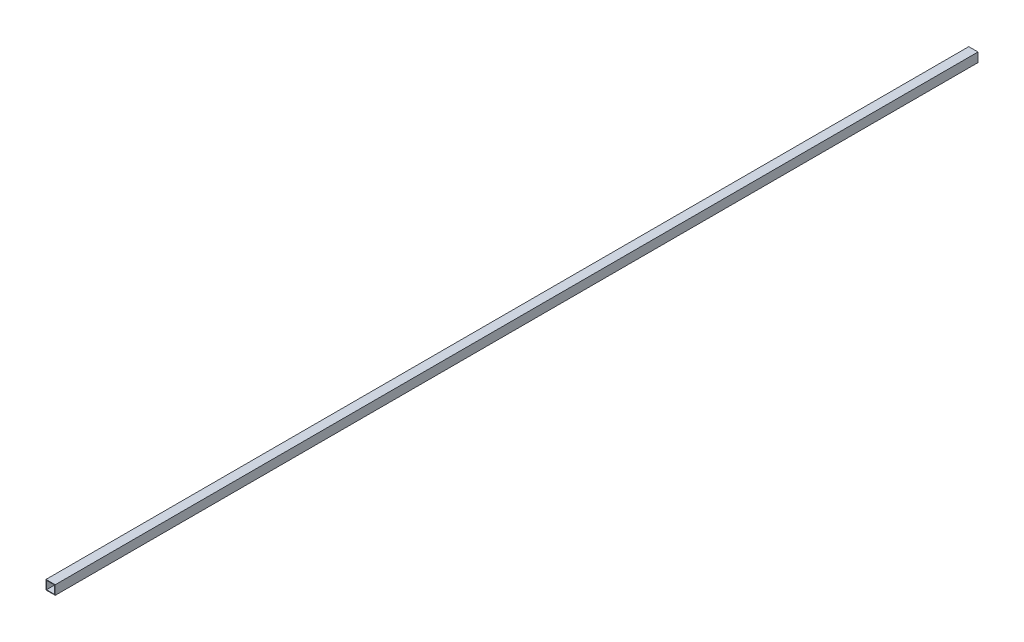
ISO-10303-21;
HEADER;
FILE_DESCRIPTION(('STEP AP214'),'2;1');
FILE_NAME('part.step','',(''),(''),'','','');
FILE_SCHEMA(('AUTOMOTIVE_DESIGN { 1 0 10303 214 1 1 1 1 }'));
ENDSEC;
DATA;
#1=APPLICATION_CONTEXT('core data for automotive mechanical design processes');
#2=APPLICATION_PROTOCOL_DEFINITION('international standard','automotive_design',2000,#1);
#3=PRODUCT_CONTEXT('',#1,'mechanical');
#4=PRODUCT('Part','Part','',(#3));
#5=PRODUCT_RELATED_PRODUCT_CATEGORY('part','',(#4));
#6=PRODUCT_DEFINITION_FORMATION('','',#4);
#7=PRODUCT_DEFINITION_CONTEXT('part definition',#1,'design');
#8=PRODUCT_DEFINITION('design','',#6,#7);
#9=PRODUCT_DEFINITION_SHAPE('','',#8);
#10=(LENGTH_UNIT() NAMED_UNIT(*) SI_UNIT(.MILLI.,.METRE.));
#11=(NAMED_UNIT(*) PLANE_ANGLE_UNIT() SI_UNIT($,.RADIAN.));
#12=(NAMED_UNIT(*) SI_UNIT($,.STERADIAN.) SOLID_ANGLE_UNIT());
#13=UNCERTAINTY_MEASURE_WITH_UNIT(LENGTH_MEASURE(1.E-05),#10,'distance_accuracy_value','');
#14=(GEOMETRIC_REPRESENTATION_CONTEXT(3) GLOBAL_UNCERTAINTY_ASSIGNED_CONTEXT((#13)) GLOBAL_UNIT_ASSIGNED_CONTEXT((#10,
#11,#12)) REPRESENTATION_CONTEXT('',''));
#15=CARTESIAN_POINT('',(0.,0.,0.));
#16=DIRECTION('',(0.,0.,1.));
#17=DIRECTION('',(1.,0.,0.));
#18=AXIS2_PLACEMENT_3D('',#15,#16,#17);
#19=CARTESIAN_POINT('',(0.,0.,1270.));
#20=DIRECTION('',(0.,0.,-1.));
#21=DIRECTION('',(-1.,0.,0.));
#22=AXIS2_PLACEMENT_3D('',#19,#20,#21);
#23=PLANE('',#22);
#24=DIRECTION('',(0.,1.,0.));
#25=VECTOR('',#24,1.);
#26=CARTESIAN_POINT('',(12.7,-12.7,1270.));
#27=LINE('',#26,#25);
#28=CARTESIAN_POINT('',(12.7,-12.7,1270.));
#29=VERTEX_POINT('',#28);
#30=CARTESIAN_POINT('',(12.7,12.7,1270.));
#31=VERTEX_POINT('',#30);
#32=EDGE_CURVE('E136',#29,#31,#27,.T.);
#33=ORIENTED_EDGE('',*,*,#32,.T.);
#34=DIRECTION('',(-1.,0.,0.));
#35=VECTOR('',#34,1.);
#36=CARTESIAN_POINT('',(-12.7,12.7,1270.));
#37=LINE('',#36,#35);
#38=CARTESIAN_POINT('',(-12.7,12.7,1270.));
#39=VERTEX_POINT('',#38);
#40=EDGE_CURVE('E139',#31,#39,#37,.T.);
#41=ORIENTED_EDGE('',*,*,#40,.T.);
#42=DIRECTION('',(0.,-1.,0.));
#43=VECTOR('',#42,1.);
#44=CARTESIAN_POINT('',(-12.7,-12.7,1270.));
#45=LINE('',#44,#43);
#46=CARTESIAN_POINT('',(-12.7,-12.7,1270.));
#47=VERTEX_POINT('',#46);
#48=EDGE_CURVE('E142',#39,#47,#45,.T.);
#49=ORIENTED_EDGE('',*,*,#48,.T.);
#50=DIRECTION('',(1.,0.,0.));
#51=VECTOR('',#50,1.);
#52=CARTESIAN_POINT('',(-12.7,-12.7,1270.));
#53=LINE('',#52,#51);
#54=EDGE_CURVE('E144',#47,#29,#53,.T.);
#55=ORIENTED_EDGE('',*,*,#54,.T.);
#56=EDGE_LOOP('',(#33,#41,#49,#55));
#57=FACE_BOUND('',#56,.T.);
#58=DIRECTION('',(0.,-1.,0.));
#59=VECTOR('',#58,1.);
#60=CARTESIAN_POINT('',(-11.1125,-11.1125,1270.));
#61=LINE('',#60,#59);
#62=CARTESIAN_POINT('',(-11.1125,11.1125,1270.));
#63=VERTEX_POINT('',#62);
#64=CARTESIAN_POINT('',(-11.1125,-11.1125,1270.));
#65=VERTEX_POINT('',#64);
#66=EDGE_CURVE('E100',#63,#65,#61,.T.);
#67=ORIENTED_EDGE('',*,*,#66,.F.);
#68=DIRECTION('',(-1.,0.,0.));
#69=VECTOR('',#68,1.);
#70=CARTESIAN_POINT('',(11.1125,11.1125,1270.));
#71=LINE('',#70,#69);
#72=CARTESIAN_POINT('',(11.1125,11.1125,1270.));
#73=VERTEX_POINT('',#72);
#74=EDGE_CURVE('E122',#73,#63,#71,.T.);
#75=ORIENTED_EDGE('',*,*,#74,.F.);
#76=DIRECTION('',(0.,1.,0.));
#77=VECTOR('',#76,1.);
#78=CARTESIAN_POINT('',(11.1125,-11.1125,1270.));
#79=LINE('',#78,#77);
#80=CARTESIAN_POINT('',(11.1125,-11.1125,1270.));
#81=VERTEX_POINT('',#80);
#82=EDGE_CURVE('E120',#81,#73,#79,.T.);
#83=ORIENTED_EDGE('',*,*,#82,.F.);
#84=DIRECTION('',(1.,0.,0.));
#85=VECTOR('',#84,1.);
#86=CARTESIAN_POINT('',(11.1125,-11.1125,1270.));
#87=LINE('',#86,#85);
#88=EDGE_CURVE('E108',#65,#81,#87,.T.);
#89=ORIENTED_EDGE('',*,*,#88,.F.);
#90=EDGE_LOOP('',(#67,#75,#83,#89));
#91=FACE_BOUND('',#90,.T.);
#92=ADVANCED_FACE('F35',(#57,#91),#23,.F.);
#93=CARTESIAN_POINT('',(0.,0.,-1270.));
#94=DIRECTION('',(0.,0.,-1.));
#95=DIRECTION('',(-1.,0.,0.));
#96=AXIS2_PLACEMENT_3D('',#93,#94,#95);
#97=PLANE('',#96);
#98=DIRECTION('',(0.,1.,0.));
#99=VECTOR('',#98,1.);
#100=CARTESIAN_POINT('',(12.7,-12.7,-1270.));
#101=LINE('',#100,#99);
#102=CARTESIAN_POINT('',(12.7,-12.7,-1270.));
#103=VERTEX_POINT('',#102);
#104=CARTESIAN_POINT('',(12.7,12.7,-1270.));
#105=VERTEX_POINT('',#104);
#106=EDGE_CURVE('E116',#103,#105,#101,.T.);
#107=ORIENTED_EDGE('',*,*,#106,.F.);
#108=DIRECTION('',(1.,0.,0.));
#109=VECTOR('',#108,1.);
#110=CARTESIAN_POINT('',(-12.7,-12.7,-1270.));
#111=LINE('',#110,#109);
#112=CARTESIAN_POINT('',(-12.7,-12.7,-1270.));
#113=VERTEX_POINT('',#112);
#114=EDGE_CURVE('E140',#113,#103,#111,.T.);
#115=ORIENTED_EDGE('',*,*,#114,.F.);
#116=DIRECTION('',(0.,-1.,0.));
#117=VECTOR('',#116,1.);
#118=CARTESIAN_POINT('',(-12.7,-12.7,-1270.));
#119=LINE('',#118,#117);
#120=CARTESIAN_POINT('',(-12.7,12.7,-1270.));
#121=VERTEX_POINT('',#120);
#122=EDGE_CURVE('E151',#121,#113,#119,.T.);
#123=ORIENTED_EDGE('',*,*,#122,.F.);
#124=DIRECTION('',(-1.,0.,0.));
#125=VECTOR('',#124,1.);
#126=CARTESIAN_POINT('',(-12.7,12.7,-1270.));
#127=LINE('',#126,#125);
#128=EDGE_CURVE('E149',#105,#121,#127,.T.);
#129=ORIENTED_EDGE('',*,*,#128,.F.);
#130=EDGE_LOOP('',(#107,#115,#123,#129));
#131=FACE_BOUND('',#130,.T.);
#132=DIRECTION('',(-1.,0.,0.));
#133=VECTOR('',#132,1.);
#134=CARTESIAN_POINT('',(11.1125,11.1125,-1270.));
#135=LINE('',#134,#133);
#136=CARTESIAN_POINT('',(11.1125,11.1125,-1270.));
#137=VERTEX_POINT('',#136);
#138=CARTESIAN_POINT('',(-11.1125,11.1125,-1270.));
#139=VERTEX_POINT('',#138);
#140=EDGE_CURVE('E109',#137,#139,#135,.T.);
#141=ORIENTED_EDGE('',*,*,#140,.T.);
#142=DIRECTION('',(0.,-1.,0.));
#143=VECTOR('',#142,1.);
#144=CARTESIAN_POINT('',(-11.1125,-11.1125,-1270.));
#145=LINE('',#144,#143);
#146=CARTESIAN_POINT('',(-11.1125,-11.1125,-1270.));
#147=VERTEX_POINT('',#146);
#148=EDGE_CURVE('E58',#139,#147,#145,.T.);
#149=ORIENTED_EDGE('',*,*,#148,.T.);
#150=DIRECTION('',(1.,0.,0.));
#151=VECTOR('',#150,1.);
#152=CARTESIAN_POINT('',(11.1125,-11.1125,-1270.));
#153=LINE('',#152,#151);
#154=CARTESIAN_POINT('',(11.1125,-11.1125,-1270.));
#155=VERTEX_POINT('',#154);
#156=EDGE_CURVE('E115',#147,#155,#153,.T.);
#157=ORIENTED_EDGE('',*,*,#156,.T.);
#158=DIRECTION('',(0.,1.,0.));
#159=VECTOR('',#158,1.);
#160=CARTESIAN_POINT('',(11.1125,-11.1125,-1270.));
#161=LINE('',#160,#159);
#162=EDGE_CURVE('E128',#155,#137,#161,.T.);
#163=ORIENTED_EDGE('',*,*,#162,.T.);
#164=EDGE_LOOP('',(#141,#149,#157,#163));
#165=FACE_BOUND('',#164,.T.);
#166=ADVANCED_FACE('F169',(#131,#165),#97,.T.);
#167=CARTESIAN_POINT('',(12.7,-12.7,1270.));
#168=DIRECTION('',(-1.,0.,0.));
#169=DIRECTION('',(0.,0.,1.));
#170=AXIS2_PLACEMENT_3D('',#167,#168,#169);
#171=PLANE('',#170);
#172=ORIENTED_EDGE('',*,*,#106,.T.);
#173=DIRECTION('',(0.,0.,-1.));
#174=VECTOR('',#173,1.);
#175=CARTESIAN_POINT('',(12.7,12.7,1270.));
#176=LINE('',#175,#174);
#177=EDGE_CURVE('E11',#31,#105,#176,.T.);
#178=ORIENTED_EDGE('',*,*,#177,.F.);
#179=ORIENTED_EDGE('',*,*,#32,.F.);
#180=DIRECTION('',(0.,0.,-1.));
#181=VECTOR('',#180,1.);
#182=CARTESIAN_POINT('',(12.7,-12.7,1270.));
#183=LINE('',#182,#181);
#184=EDGE_CURVE('E146',#29,#103,#183,.T.);
#185=ORIENTED_EDGE('',*,*,#184,.T.);
#186=EDGE_LOOP('',(#172,#178,#179,#185));
#187=FACE_BOUND('',#186,.T.);
#188=ADVANCED_FACE('F37',(#187),#171,.F.);
#189=CARTESIAN_POINT('',(-12.7,12.7,1270.));
#190=DIRECTION('',(0.,-1.,0.));
#191=DIRECTION('',(0.,0.,-1.));
#192=AXIS2_PLACEMENT_3D('',#189,#190,#191);
#193=PLANE('',#192);
#194=ORIENTED_EDGE('',*,*,#128,.T.);
#195=DIRECTION('',(0.,0.,-1.));
#196=VECTOR('',#195,1.);
#197=CARTESIAN_POINT('',(-12.7,12.7,1270.));
#198=LINE('',#197,#196);
#199=EDGE_CURVE('E43',#39,#121,#198,.T.);
#200=ORIENTED_EDGE('',*,*,#199,.F.);
#201=ORIENTED_EDGE('',*,*,#40,.F.);
#202=ORIENTED_EDGE('',*,*,#177,.T.);
#203=EDGE_LOOP('',(#194,#200,#201,#202));
#204=FACE_BOUND('',#203,.T.);
#205=ADVANCED_FACE('F179',(#204),#193,.F.);
#206=CARTESIAN_POINT('',(-12.7,-12.7,1270.));
#207=DIRECTION('',(1.,0.,0.));
#208=DIRECTION('',(0.,0.,-1.));
#209=AXIS2_PLACEMENT_3D('',#206,#207,#208);
#210=PLANE('',#209);
#211=ORIENTED_EDGE('',*,*,#122,.T.);
#212=DIRECTION('',(0.,0.,-1.));
#213=VECTOR('',#212,1.);
#214=CARTESIAN_POINT('',(-12.7,-12.7,1270.));
#215=LINE('',#214,#213);
#216=EDGE_CURVE('E156',#47,#113,#215,.T.);
#217=ORIENTED_EDGE('',*,*,#216,.F.);
#218=ORIENTED_EDGE('',*,*,#48,.F.);
#219=ORIENTED_EDGE('',*,*,#199,.T.);
#220=EDGE_LOOP('',(#211,#217,#218,#219));
#221=FACE_BOUND('',#220,.T.);
#222=ADVANCED_FACE('F163',(#221),#210,.F.);
#223=CARTESIAN_POINT('',(-12.7,-12.7,1270.));
#224=DIRECTION('',(0.,1.,0.));
#225=DIRECTION('',(0.,0.,1.));
#226=AXIS2_PLACEMENT_3D('',#223,#224,#225);
#227=PLANE('',#226);
#228=ORIENTED_EDGE('',*,*,#114,.T.);
#229=ORIENTED_EDGE('',*,*,#184,.F.);
#230=ORIENTED_EDGE('',*,*,#54,.F.);
#231=ORIENTED_EDGE('',*,*,#216,.T.);
#232=EDGE_LOOP('',(#228,#229,#230,#231));
#233=FACE_BOUND('',#232,.T.);
#234=ADVANCED_FACE('F173',(#233),#227,.F.);
#235=CARTESIAN_POINT('',(-11.1125,-11.1125,1270.));
#236=DIRECTION('',(1.,0.,0.));
#237=DIRECTION('',(0.,0.,-1.));
#238=AXIS2_PLACEMENT_3D('',#235,#236,#237);
#239=PLANE('',#238);
#240=ORIENTED_EDGE('',*,*,#148,.F.);
#241=DIRECTION('',(0.,0.,-1.));
#242=VECTOR('',#241,1.);
#243=CARTESIAN_POINT('',(-11.1125,11.1125,1270.));
#244=LINE('',#243,#242);
#245=EDGE_CURVE('E104',#63,#139,#244,.T.);
#246=ORIENTED_EDGE('',*,*,#245,.F.);
#247=ORIENTED_EDGE('',*,*,#66,.T.);
#248=DIRECTION('',(0.,0.,-1.));
#249=VECTOR('',#248,1.);
#250=CARTESIAN_POINT('',(-11.1125,-11.1125,1270.));
#251=LINE('',#250,#249);
#252=EDGE_CURVE('E103',#65,#147,#251,.T.);
#253=ORIENTED_EDGE('',*,*,#252,.T.);
#254=EDGE_LOOP('',(#240,#246,#247,#253));
#255=FACE_BOUND('',#254,.T.);
#256=ADVANCED_FACE('F102',(#255),#239,.T.);
#257=CARTESIAN_POINT('',(11.1125,-11.1125,1270.));
#258=DIRECTION('',(0.,1.,0.));
#259=DIRECTION('',(0.,0.,1.));
#260=AXIS2_PLACEMENT_3D('',#257,#258,#259);
#261=PLANE('',#260);
#262=ORIENTED_EDGE('',*,*,#156,.F.);
#263=ORIENTED_EDGE('',*,*,#252,.F.);
#264=ORIENTED_EDGE('',*,*,#88,.T.);
#265=DIRECTION('',(0.,0.,-1.));
#266=VECTOR('',#265,1.);
#267=CARTESIAN_POINT('',(11.1125,-11.1125,1270.));
#268=LINE('',#267,#266);
#269=EDGE_CURVE('E117',#81,#155,#268,.T.);
#270=ORIENTED_EDGE('',*,*,#269,.T.);
#271=EDGE_LOOP('',(#262,#263,#264,#270));
#272=FACE_BOUND('',#271,.T.);
#273=ADVANCED_FACE('F112',(#272),#261,.T.);
#274=CARTESIAN_POINT('',(11.1125,-11.1125,1270.));
#275=DIRECTION('',(-1.,0.,0.));
#276=DIRECTION('',(0.,0.,1.));
#277=AXIS2_PLACEMENT_3D('',#274,#275,#276);
#278=PLANE('',#277);
#279=ORIENTED_EDGE('',*,*,#162,.F.);
#280=ORIENTED_EDGE('',*,*,#269,.F.);
#281=ORIENTED_EDGE('',*,*,#82,.T.);
#282=DIRECTION('',(0.,0.,-1.));
#283=VECTOR('',#282,1.);
#284=CARTESIAN_POINT('',(11.1125,11.1125,1270.));
#285=LINE('',#284,#283);
#286=EDGE_CURVE('E50',#73,#137,#285,.T.);
#287=ORIENTED_EDGE('',*,*,#286,.T.);
#288=EDGE_LOOP('',(#279,#280,#281,#287));
#289=FACE_BOUND('',#288,.T.);
#290=ADVANCED_FACE('F202',(#289),#278,.T.);
#291=CARTESIAN_POINT('',(11.1125,11.1125,1270.));
#292=DIRECTION('',(0.,-1.,0.));
#293=DIRECTION('',(0.,0.,-1.));
#294=AXIS2_PLACEMENT_3D('',#291,#292,#293);
#295=PLANE('',#294);
#296=ORIENTED_EDGE('',*,*,#140,.F.);
#297=ORIENTED_EDGE('',*,*,#286,.F.);
#298=ORIENTED_EDGE('',*,*,#74,.T.);
#299=ORIENTED_EDGE('',*,*,#245,.T.);
#300=EDGE_LOOP('',(#296,#297,#298,#299));
#301=FACE_BOUND('',#300,.T.);
#302=ADVANCED_FACE('F206',(#301),#295,.T.);
#303=CLOSED_SHELL('',(#92,#166,#188,#205,#222,#234,#256,#273,#290,#302));
#304=MANIFOLD_SOLID_BREP('B2',#303);
#305=ADVANCED_BREP_SHAPE_REPRESENTATION('',(#18,#304),#14);
#306=SHAPE_DEFINITION_REPRESENTATION(#9,#305);
ENDSEC;
END-ISO-10303-21;
